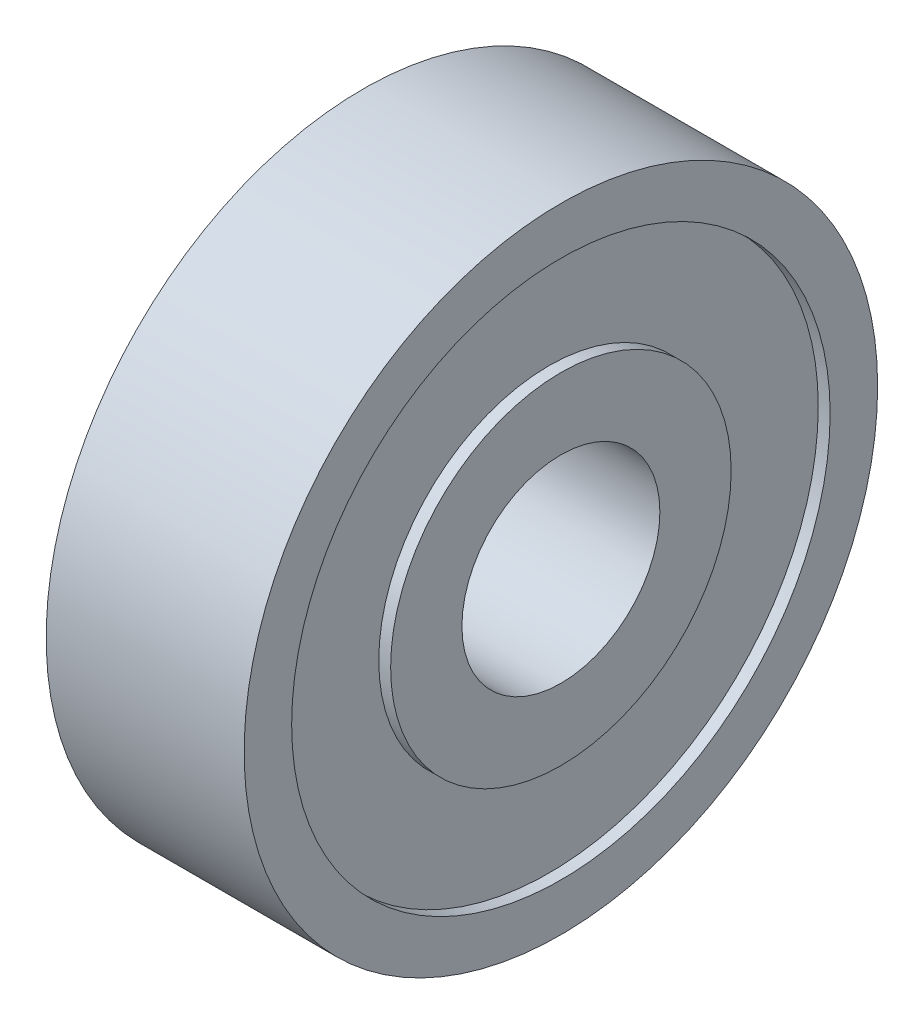
ISO-10303-21;
HEADER;
FILE_DESCRIPTION(('STEP AP214'),'2;1');
FILE_NAME('part.step','',(''),(''),'','','');
FILE_SCHEMA(('AUTOMOTIVE_DESIGN { 1 0 10303 214 1 1 1 1 }'));
ENDSEC;
DATA;
#1=APPLICATION_CONTEXT('core data for automotive mechanical design processes');
#2=APPLICATION_PROTOCOL_DEFINITION('international standard','automotive_design',2000,#1);
#3=PRODUCT_CONTEXT('',#1,'mechanical');
#4=PRODUCT('Part','Part','',(#3));
#5=PRODUCT_RELATED_PRODUCT_CATEGORY('part','',(#4));
#6=PRODUCT_DEFINITION_FORMATION('','',#4);
#7=PRODUCT_DEFINITION_CONTEXT('part definition',#1,'design');
#8=PRODUCT_DEFINITION('design','',#6,#7);
#9=PRODUCT_DEFINITION_SHAPE('','',#8);
#10=(LENGTH_UNIT() NAMED_UNIT(*) SI_UNIT(.MILLI.,.METRE.));
#11=(NAMED_UNIT(*) PLANE_ANGLE_UNIT() SI_UNIT($,.RADIAN.));
#12=(NAMED_UNIT(*) SI_UNIT($,.STERADIAN.) SOLID_ANGLE_UNIT());
#13=UNCERTAINTY_MEASURE_WITH_UNIT(LENGTH_MEASURE(1.E-05),#10,'distance_accuracy_value','');
#14=(GEOMETRIC_REPRESENTATION_CONTEXT(3) GLOBAL_UNCERTAINTY_ASSIGNED_CONTEXT((#13)) GLOBAL_UNIT_ASSIGNED_CONTEXT((#10,
#11,#12)) REPRESENTATION_CONTEXT('',''));
#15=CARTESIAN_POINT('',(0.,0.,0.));
#16=DIRECTION('',(0.,0.,1.));
#17=DIRECTION('',(1.,0.,0.));
#18=AXIS2_PLACEMENT_3D('',#15,#16,#17);
#19=CARTESIAN_POINT('',(-2.5,2.5,0.));
#20=DIRECTION('',(-1.,0.,0.));
#21=DIRECTION('',(0.,0.,1.));
#22=AXIS2_PLACEMENT_3D('',#19,#20,#21);
#23=PLANE('',#22);
#24=CARTESIAN_POINT('',(-2.5,0.,0.));
#25=DIRECTION('',(1.,0.,0.));
#26=DIRECTION('',(0.,0.,-1.));
#27=AXIS2_PLACEMENT_3D('',#24,#25,#26);
#28=CIRCLE('',#27,2.5);
#29=CARTESIAN_POINT('',(-2.5,0.,-2.5));
#30=VERTEX_POINT('',#29);
#31=EDGE_CURVE('E83',#30,#30,#28,.T.);
#32=ORIENTED_EDGE('',*,*,#31,.T.);
#33=EDGE_LOOP('',(#32));
#34=FACE_BOUND('',#33,.T.);
#35=CARTESIAN_POINT('',(-2.5,0.,0.));
#36=DIRECTION('',(1.,0.,0.));
#37=DIRECTION('',(0.,0.,-1.));
#38=AXIS2_PLACEMENT_3D('',#35,#36,#37);
#39=CIRCLE('',#38,4.3);
#40=CARTESIAN_POINT('',(-2.5,0.,-4.3));
#41=VERTEX_POINT('',#40);
#42=EDGE_CURVE('E10',#41,#41,#39,.T.);
#43=ORIENTED_EDGE('',*,*,#42,.F.);
#44=EDGE_LOOP('',(#43));
#45=FACE_BOUND('',#44,.T.);
#46=ADVANCED_FACE('F43',(#34,#45),#23,.T.);
#47=CARTESIAN_POINT('',(0.,0.,0.));
#48=DIRECTION('',(1.,0.,0.));
#49=DIRECTION('',(0.,0.,-1.));
#50=AXIS2_PLACEMENT_3D('',#47,#48,#49);
#51=CYLINDRICAL_SURFACE('',#50,4.3);
#52=ORIENTED_EDGE('',*,*,#42,.T.);
#53=EDGE_LOOP('',(#52));
#54=FACE_BOUND('',#53,.T.);
#55=CARTESIAN_POINT('',(-2.2,0.,0.));
#56=DIRECTION('',(1.,0.,0.));
#57=DIRECTION('',(0.,0.,-1.));
#58=AXIS2_PLACEMENT_3D('',#55,#56,#57);
#59=CIRCLE('',#58,4.3);
#60=CARTESIAN_POINT('',(-2.2,0.,-4.3));
#61=VERTEX_POINT('',#60);
#62=EDGE_CURVE('E49',#61,#61,#59,.T.);
#63=ORIENTED_EDGE('',*,*,#62,.F.);
#64=EDGE_LOOP('',(#63));
#65=FACE_BOUND('',#64,.T.);
#66=ADVANCED_FACE('F101',(#54,#65),#51,.T.);
#67=CARTESIAN_POINT('',(-2.2,4.3,0.));
#68=DIRECTION('',(-1.,0.,0.));
#69=DIRECTION('',(0.,0.,1.));
#70=AXIS2_PLACEMENT_3D('',#67,#68,#69);
#71=PLANE('',#70);
#72=ORIENTED_EDGE('',*,*,#62,.T.);
#73=EDGE_LOOP('',(#72));
#74=FACE_BOUND('',#73,.T.);
#75=CARTESIAN_POINT('',(-2.2,0.,0.));
#76=DIRECTION('',(1.,0.,0.));
#77=DIRECTION('',(0.,0.,-1.));
#78=AXIS2_PLACEMENT_3D('',#75,#76,#77);
#79=CIRCLE('',#78,6.8);
#80=CARTESIAN_POINT('',(-2.2,0.,-6.8));
#81=VERTEX_POINT('',#80);
#82=EDGE_CURVE('E53',#81,#81,#79,.T.);
#83=ORIENTED_EDGE('',*,*,#82,.F.);
#84=EDGE_LOOP('',(#83));
#85=FACE_BOUND('',#84,.T.);
#86=ADVANCED_FACE('F105',(#74,#85),#71,.T.);
#87=CARTESIAN_POINT('',(0.,0.,0.));
#88=DIRECTION('',(1.,0.,0.));
#89=DIRECTION('',(0.,0.,-1.));
#90=AXIS2_PLACEMENT_3D('',#87,#88,#89);
#91=CYLINDRICAL_SURFACE('',#90,6.8);
#92=ORIENTED_EDGE('',*,*,#82,.T.);
#93=EDGE_LOOP('',(#92));
#94=FACE_BOUND('',#93,.T.);
#95=CARTESIAN_POINT('',(-2.5,0.,0.));
#96=DIRECTION('',(1.,0.,0.));
#97=DIRECTION('',(0.,0.,-1.));
#98=AXIS2_PLACEMENT_3D('',#95,#96,#97);
#99=CIRCLE('',#98,6.8);
#100=CARTESIAN_POINT('',(-2.5,0.,-6.8));
#101=VERTEX_POINT('',#100);
#102=EDGE_CURVE('E57',#101,#101,#99,.T.);
#103=ORIENTED_EDGE('',*,*,#102,.F.);
#104=EDGE_LOOP('',(#103));
#105=FACE_BOUND('',#104,.T.);
#106=ADVANCED_FACE('F110',(#94,#105),#91,.F.);
#107=CARTESIAN_POINT('',(-2.5,6.8,0.));
#108=DIRECTION('',(-1.,0.,0.));
#109=DIRECTION('',(0.,0.,1.));
#110=AXIS2_PLACEMENT_3D('',#107,#108,#109);
#111=PLANE('',#110);
#112=ORIENTED_EDGE('',*,*,#102,.T.);
#113=EDGE_LOOP('',(#112));
#114=FACE_BOUND('',#113,.T.);
#115=CARTESIAN_POINT('',(-2.5,0.,0.));
#116=DIRECTION('',(1.,0.,0.));
#117=DIRECTION('',(0.,0.,-1.));
#118=AXIS2_PLACEMENT_3D('',#115,#116,#117);
#119=CIRCLE('',#118,8.);
#120=CARTESIAN_POINT('',(-2.5,0.,-8.));
#121=VERTEX_POINT('',#120);
#122=EDGE_CURVE('E62',#121,#121,#119,.T.);
#123=ORIENTED_EDGE('',*,*,#122,.F.);
#124=EDGE_LOOP('',(#123));
#125=FACE_BOUND('',#124,.T.);
#126=ADVANCED_FACE('F116',(#114,#125),#111,.T.);
#127=CARTESIAN_POINT('',(0.,0.,0.));
#128=DIRECTION('',(1.,0.,0.));
#129=DIRECTION('',(0.,0.,-1.));
#130=AXIS2_PLACEMENT_3D('',#127,#128,#129);
#131=CYLINDRICAL_SURFACE('',#130,8.);
#132=ORIENTED_EDGE('',*,*,#122,.T.);
#133=EDGE_LOOP('',(#132));
#134=FACE_BOUND('',#133,.T.);
#135=CARTESIAN_POINT('',(2.5,0.,0.));
#136=DIRECTION('',(1.,0.,0.));
#137=DIRECTION('',(0.,0.,-1.));
#138=AXIS2_PLACEMENT_3D('',#135,#136,#137);
#139=CIRCLE('',#138,8.);
#140=CARTESIAN_POINT('',(2.5,0.,-8.));
#141=VERTEX_POINT('',#140);
#142=EDGE_CURVE('E65',#141,#141,#139,.T.);
#143=ORIENTED_EDGE('',*,*,#142,.F.);
#144=EDGE_LOOP('',(#143));
#145=FACE_BOUND('',#144,.T.);
#146=ADVANCED_FACE('F120',(#134,#145),#131,.T.);
#147=CARTESIAN_POINT('',(2.5,6.8,0.));
#148=DIRECTION('',(1.,0.,0.));
#149=DIRECTION('',(0.,0.,-1.));
#150=AXIS2_PLACEMENT_3D('',#147,#148,#149);
#151=PLANE('',#150);
#152=ORIENTED_EDGE('',*,*,#142,.T.);
#153=EDGE_LOOP('',(#152));
#154=FACE_BOUND('',#153,.T.);
#155=CARTESIAN_POINT('',(2.5,0.,0.));
#156=DIRECTION('',(1.,0.,0.));
#157=DIRECTION('',(0.,0.,-1.));
#158=AXIS2_PLACEMENT_3D('',#155,#156,#157);
#159=CIRCLE('',#158,6.8);
#160=CARTESIAN_POINT('',(2.5,0.,-6.8));
#161=VERTEX_POINT('',#160);
#162=EDGE_CURVE('E68',#161,#161,#159,.T.);
#163=ORIENTED_EDGE('',*,*,#162,.F.);
#164=EDGE_LOOP('',(#163));
#165=FACE_BOUND('',#164,.T.);
#166=ADVANCED_FACE('F124',(#154,#165),#151,.T.);
#167=CARTESIAN_POINT('',(0.,0.,0.));
#168=DIRECTION('',(1.,0.,0.));
#169=DIRECTION('',(0.,0.,-1.));
#170=AXIS2_PLACEMENT_3D('',#167,#168,#169);
#171=CYLINDRICAL_SURFACE('',#170,6.8);
#172=ORIENTED_EDGE('',*,*,#162,.T.);
#173=EDGE_LOOP('',(#172));
#174=FACE_BOUND('',#173,.T.);
#175=CARTESIAN_POINT('',(2.2,0.,0.));
#176=DIRECTION('',(1.,0.,0.));
#177=DIRECTION('',(0.,0.,-1.));
#178=AXIS2_PLACEMENT_3D('',#175,#176,#177);
#179=CIRCLE('',#178,6.8);
#180=CARTESIAN_POINT('',(2.2,0.,-6.8));
#181=VERTEX_POINT('',#180);
#182=EDGE_CURVE('E71',#181,#181,#179,.T.);
#183=ORIENTED_EDGE('',*,*,#182,.F.);
#184=EDGE_LOOP('',(#183));
#185=FACE_BOUND('',#184,.T.);
#186=ADVANCED_FACE('F128',(#174,#185),#171,.F.);
#187=CARTESIAN_POINT('',(2.2,4.3,0.));
#188=DIRECTION('',(1.,0.,0.));
#189=DIRECTION('',(0.,0.,-1.));
#190=AXIS2_PLACEMENT_3D('',#187,#188,#189);
#191=PLANE('',#190);
#192=ORIENTED_EDGE('',*,*,#182,.T.);
#193=EDGE_LOOP('',(#192));
#194=FACE_BOUND('',#193,.T.);
#195=CARTESIAN_POINT('',(2.2,0.,0.));
#196=DIRECTION('',(1.,0.,0.));
#197=DIRECTION('',(0.,0.,-1.));
#198=AXIS2_PLACEMENT_3D('',#195,#196,#197);
#199=CIRCLE('',#198,4.3);
#200=CARTESIAN_POINT('',(2.2,0.,-4.3));
#201=VERTEX_POINT('',#200);
#202=EDGE_CURVE('E74',#201,#201,#199,.T.);
#203=ORIENTED_EDGE('',*,*,#202,.F.);
#204=EDGE_LOOP('',(#203));
#205=FACE_BOUND('',#204,.T.);
#206=ADVANCED_FACE('F132',(#194,#205),#191,.T.);
#207=CARTESIAN_POINT('',(0.,0.,0.));
#208=DIRECTION('',(1.,0.,0.));
#209=DIRECTION('',(0.,0.,-1.));
#210=AXIS2_PLACEMENT_3D('',#207,#208,#209);
#211=CYLINDRICAL_SURFACE('',#210,4.3);
#212=ORIENTED_EDGE('',*,*,#202,.T.);
#213=EDGE_LOOP('',(#212));
#214=FACE_BOUND('',#213,.T.);
#215=CARTESIAN_POINT('',(2.5,0.,0.));
#216=DIRECTION('',(1.,0.,0.));
#217=DIRECTION('',(0.,0.,-1.));
#218=AXIS2_PLACEMENT_3D('',#215,#216,#217);
#219=CIRCLE('',#218,4.3);
#220=CARTESIAN_POINT('',(2.5,0.,-4.3));
#221=VERTEX_POINT('',#220);
#222=EDGE_CURVE('E77',#221,#221,#219,.T.);
#223=ORIENTED_EDGE('',*,*,#222,.F.);
#224=EDGE_LOOP('',(#223));
#225=FACE_BOUND('',#224,.T.);
#226=ADVANCED_FACE('F97',(#214,#225),#211,.T.);
#227=CARTESIAN_POINT('',(2.5,2.5,0.));
#228=DIRECTION('',(1.,0.,0.));
#229=DIRECTION('',(0.,0.,-1.));
#230=AXIS2_PLACEMENT_3D('',#227,#228,#229);
#231=PLANE('',#230);
#232=ORIENTED_EDGE('',*,*,#222,.T.);
#233=EDGE_LOOP('',(#232));
#234=FACE_BOUND('',#233,.T.);
#235=CARTESIAN_POINT('',(2.5,0.,0.));
#236=DIRECTION('',(1.,0.,0.));
#237=DIRECTION('',(0.,0.,-1.));
#238=AXIS2_PLACEMENT_3D('',#235,#236,#237);
#239=CIRCLE('',#238,2.5);
#240=CARTESIAN_POINT('',(2.5,0.,-2.5));
#241=VERTEX_POINT('',#240);
#242=EDGE_CURVE('E80',#241,#241,#239,.T.);
#243=ORIENTED_EDGE('',*,*,#242,.F.);
#244=EDGE_LOOP('',(#243));
#245=FACE_BOUND('',#244,.T.);
#246=ADVANCED_FACE('F91',(#234,#245),#231,.T.);
#247=CARTESIAN_POINT('',(0.,0.,0.));
#248=DIRECTION('',(1.,0.,0.));
#249=DIRECTION('',(0.,0.,-1.));
#250=AXIS2_PLACEMENT_3D('',#247,#248,#249);
#251=CYLINDRICAL_SURFACE('',#250,2.5);
#252=ORIENTED_EDGE('',*,*,#242,.T.);
#253=EDGE_LOOP('',(#252));
#254=FACE_BOUND('',#253,.T.);
#255=ORIENTED_EDGE('',*,*,#31,.F.);
#256=EDGE_LOOP('',(#255));
#257=FACE_BOUND('',#256,.T.);
#258=ADVANCED_FACE('F89',(#254,#257),#251,.F.);
#259=CLOSED_SHELL('',(#46,#66,#86,#106,#126,#146,#166,#186,#206,#226,#246,#258));
#260=MANIFOLD_SOLID_BREP('B2',#259);
#261=ADVANCED_BREP_SHAPE_REPRESENTATION('',(#18,#260),#14);
#262=SHAPE_DEFINITION_REPRESENTATION(#9,#261);
ENDSEC;
END-ISO-10303-21;
